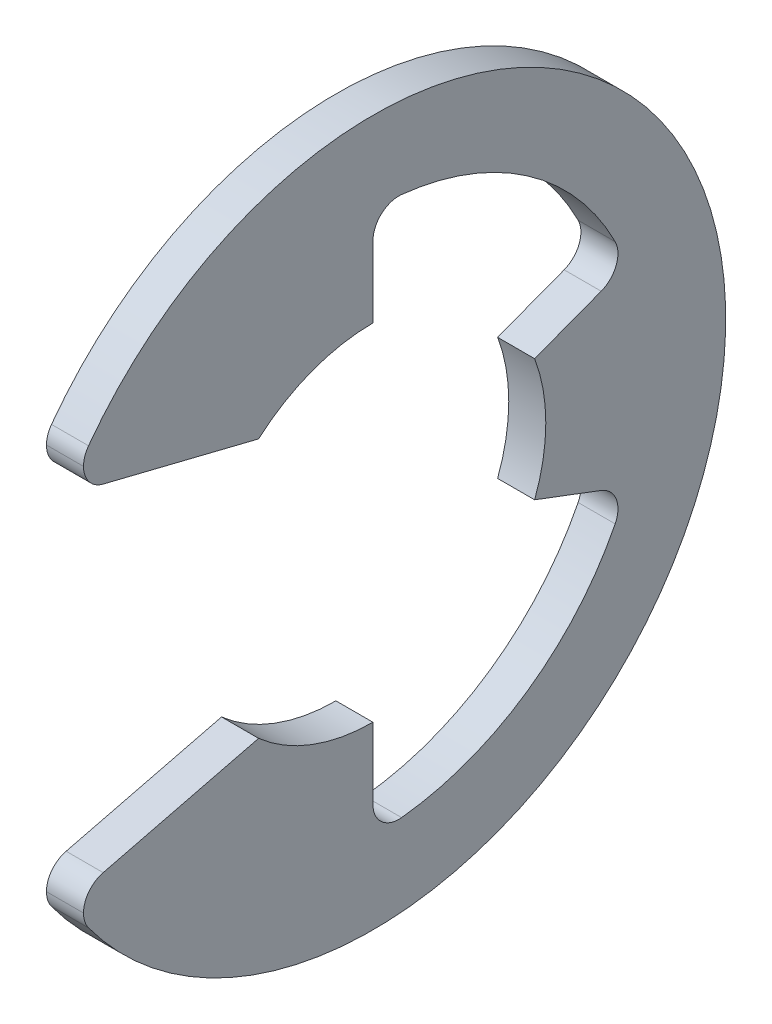
ISO-10303-21;
HEADER;
FILE_DESCRIPTION(('STEP AP214'),'2;1');
FILE_NAME('part.step','',(''),(''),'','','');
FILE_SCHEMA(('AUTOMOTIVE_DESIGN { 1 0 10303 214 1 1 1 1 }'));
ENDSEC;
DATA;
#1=APPLICATION_CONTEXT('core data for automotive mechanical design processes');
#2=APPLICATION_PROTOCOL_DEFINITION('international standard','automotive_design',2000,#1);
#3=PRODUCT_CONTEXT('',#1,'mechanical');
#4=PRODUCT('Part','Part','',(#3));
#5=PRODUCT_RELATED_PRODUCT_CATEGORY('part','',(#4));
#6=PRODUCT_DEFINITION_FORMATION('','',#4);
#7=PRODUCT_DEFINITION_CONTEXT('part definition',#1,'design');
#8=PRODUCT_DEFINITION('design','',#6,#7);
#9=PRODUCT_DEFINITION_SHAPE('','',#8);
#10=(LENGTH_UNIT() NAMED_UNIT(*) SI_UNIT(.MILLI.,.METRE.));
#11=(NAMED_UNIT(*) PLANE_ANGLE_UNIT() SI_UNIT($,.RADIAN.));
#12=(NAMED_UNIT(*) SI_UNIT($,.STERADIAN.) SOLID_ANGLE_UNIT());
#13=UNCERTAINTY_MEASURE_WITH_UNIT(LENGTH_MEASURE(1.E-05),#10,'distance_accuracy_value','');
#14=(GEOMETRIC_REPRESENTATION_CONTEXT(3) GLOBAL_UNCERTAINTY_ASSIGNED_CONTEXT((#13)) GLOBAL_UNIT_ASSIGNED_CONTEXT((#10,
#11,#12)) REPRESENTATION_CONTEXT('',''));
#15=CARTESIAN_POINT('',(0.,0.,0.));
#16=DIRECTION('',(0.,0.,1.));
#17=DIRECTION('',(1.,0.,0.));
#18=AXIS2_PLACEMENT_3D('',#15,#16,#17);
#19=CARTESIAN_POINT('',(0.5334,3.18296391887085,-6.30917472174839));
#20=DIRECTION('',(-1.,0.,0.));
#21=DIRECTION('',(0.,0.,1.));
#22=AXIS2_PLACEMENT_3D('',#19,#20,#21);
#23=CYLINDRICAL_SURFACE('',#22,0.74676);
#24=CARTESIAN_POINT('',(0.5334,3.18296391887085,-6.30917472174839));
#25=DIRECTION('',(-1.,0.,0.));
#26=DIRECTION('',(0.,0.,-1.));
#27=AXIS2_PLACEMENT_3D('',#24,#25,#26);
#28=CIRCLE('',#27,0.74676);
#29=CARTESIAN_POINT('',(0.5334,3.51932193149276,-6.97589339176224));
#30=VERTEX_POINT('',#29);
#31=CARTESIAN_POINT('',(0.5334,2.48443390133403,-6.57319425170782));
#32=VERTEX_POINT('',#31);
#33=EDGE_CURVE('E407',#30,#32,#28,.T.);
#34=ORIENTED_EDGE('',*,*,#33,.F.);
#35=DIRECTION('',(1.,0.,0.));
#36=VECTOR('',#35,1.);
#37=CARTESIAN_POINT('',(0.5334,3.51932193149276,-6.97589339176224));
#38=LINE('',#37,#36);
#39=CARTESIAN_POINT('',(-0.5334,3.51932193149276,-6.97589339176224));
#40=VERTEX_POINT('',#39);
#41=EDGE_CURVE('E288',#40,#30,#38,.T.);
#42=ORIENTED_EDGE('',*,*,#41,.F.);
#43=CARTESIAN_POINT('',(-0.5334,3.18296391887085,-6.30917472174839));
#44=DIRECTION('',(1.,0.,0.));
#45=DIRECTION('',(0.,0.,-1.));
#46=AXIS2_PLACEMENT_3D('',#43,#44,#45);
#47=CIRCLE('',#46,0.74676);
#48=CARTESIAN_POINT('',(-0.5334,2.48443390133403,-6.57319425170782));
#49=VERTEX_POINT('',#48);
#50=EDGE_CURVE('E424',#49,#40,#47,.T.);
#51=ORIENTED_EDGE('',*,*,#50,.F.);
#52=DIRECTION('',(-1.,0.,0.));
#53=VECTOR('',#52,1.);
#54=CARTESIAN_POINT('',(-0.5334,2.48443390133403,-6.57319425170782));
#55=LINE('',#54,#53);
#56=EDGE_CURVE('E238',#32,#49,#55,.T.);
#57=ORIENTED_EDGE('',*,*,#56,.F.);
#58=EDGE_LOOP('',(#34,#42,#51,#57));
#59=FACE_BOUND('',#58,.T.);
#60=ADVANCED_FACE('F16',(#59),#23,.F.);
#61=CARTESIAN_POINT('',(0.5334,-3.18296391887085,-6.30917472174839));
#62=DIRECTION('',(-1.,0.,0.));
#63=DIRECTION('',(0.,0.,1.));
#64=AXIS2_PLACEMENT_3D('',#61,#62,#63);
#65=CYLINDRICAL_SURFACE('',#64,0.74676);
#66=CARTESIAN_POINT('',(0.5334,-3.18296391887085,-6.30917472174839));
#67=DIRECTION('',(-1.,0.,0.));
#68=DIRECTION('',(0.,0.,-1.));
#69=AXIS2_PLACEMENT_3D('',#66,#67,#68);
#70=CIRCLE('',#69,0.74676);
#71=CARTESIAN_POINT('',(0.5334,-2.48443390133402,-6.57319425170782));
#72=VERTEX_POINT('',#71);
#73=CARTESIAN_POINT('',(0.5334,-3.51932193149276,-6.97589339176224));
#74=VERTEX_POINT('',#73);
#75=EDGE_CURVE('E410',#72,#74,#70,.T.);
#76=ORIENTED_EDGE('',*,*,#75,.F.);
#77=DIRECTION('',(1.,0.,0.));
#78=VECTOR('',#77,1.);
#79=CARTESIAN_POINT('',(0.5334,-2.48443390133402,-6.57319425170782));
#80=LINE('',#79,#78);
#81=CARTESIAN_POINT('',(-0.5334,-2.48443390133402,-6.57319425170782));
#82=VERTEX_POINT('',#81);
#83=EDGE_CURVE('E350',#82,#72,#80,.T.);
#84=ORIENTED_EDGE('',*,*,#83,.F.);
#85=CARTESIAN_POINT('',(-0.5334,-3.18296391887085,-6.30917472174839));
#86=DIRECTION('',(1.,0.,0.));
#87=DIRECTION('',(0.,0.,-1.));
#88=AXIS2_PLACEMENT_3D('',#85,#86,#87);
#89=CIRCLE('',#88,0.74676);
#90=CARTESIAN_POINT('',(-0.5334,-3.51932193149276,-6.97589339176224));
#91=VERTEX_POINT('',#90);
#92=EDGE_CURVE('E421',#91,#82,#89,.T.);
#93=ORIENTED_EDGE('',*,*,#92,.F.);
#94=DIRECTION('',(-1.,0.,0.));
#95=VECTOR('',#94,1.);
#96=CARTESIAN_POINT('',(0.5334,-3.51932193149276,-6.97589339176224));
#97=LINE('',#96,#95);
#98=EDGE_CURVE('E370',#74,#91,#97,.T.);
#99=ORIENTED_EDGE('',*,*,#98,.F.);
#100=EDGE_LOOP('',(#76,#84,#93,#99));
#101=FACE_BOUND('',#100,.T.);
#102=ADVANCED_FACE('F18',(#101),#65,.F.);
#103=CARTESIAN_POINT('',(0.5334,5.56971982551659,7.58863020332704));
#104=DIRECTION('',(-1.,0.,0.));
#105=DIRECTION('',(0.,0.,1.));
#106=AXIS2_PLACEMENT_3D('',#103,#104,#105);
#107=CYLINDRICAL_SURFACE('',#106,0.74676);
#108=DIRECTION('',(-1.,0.,0.));
#109=VECTOR('',#108,1.);
#110=CARTESIAN_POINT('',(0.5334,5.56971982551659,8.33539020332704));
#111=LINE('',#110,#109);
#112=CARTESIAN_POINT('',(0.5334,5.56971982551659,8.33539020332704));
#113=VERTEX_POINT('',#112);
#114=CARTESIAN_POINT('',(-0.5334,5.56971982551659,8.33539020332704));
#115=VERTEX_POINT('',#114);
#116=EDGE_CURVE('E217',#113,#115,#111,.T.);
#117=ORIENTED_EDGE('',*,*,#116,.F.);
#118=CARTESIAN_POINT('',(0.5334,5.56971982551659,7.58863020332704));
#119=DIRECTION('',(1.,0.,0.));
#120=DIRECTION('',(0.,0.,-1.));
#121=AXIS2_PLACEMENT_3D('',#118,#119,#120);
#122=CIRCLE('',#121,0.74676);
#123=CARTESIAN_POINT('',(0.5334,6.01157023801035,8.19064242129201));
#124=VERTEX_POINT('',#123);
#125=EDGE_CURVE('E202',#124,#113,#122,.T.);
#126=ORIENTED_EDGE('',*,*,#125,.F.);
#127=DIRECTION('',(1.,0.,0.));
#128=VECTOR('',#127,1.);
#129=CARTESIAN_POINT('',(0.5334,6.01157023801035,8.19064242129201));
#130=LINE('',#129,#128);
#131=CARTESIAN_POINT('',(-0.5334,6.01157023801035,8.19064242129201));
#132=VERTEX_POINT('',#131);
#133=EDGE_CURVE('E280',#132,#124,#130,.T.);
#134=ORIENTED_EDGE('',*,*,#133,.F.);
#135=CARTESIAN_POINT('',(-0.5334,5.56971982551659,7.58863020332704));
#136=DIRECTION('',(-1.,0.,0.));
#137=DIRECTION('',(0.,0.,-1.));
#138=AXIS2_PLACEMENT_3D('',#135,#136,#137);
#139=CIRCLE('',#138,0.74676);
#140=EDGE_CURVE('E11',#115,#132,#139,.T.);
#141=ORIENTED_EDGE('',*,*,#140,.F.);
#142=EDGE_LOOP('',(#117,#126,#134,#141));
#143=FACE_BOUND('',#142,.T.);
#144=ADVANCED_FACE('F218',(#143),#107,.T.);
#145=CARTESIAN_POINT('',(0.5334,-5.56971982551659,7.58863020332704));
#146=DIRECTION('',(-1.,0.,0.));
#147=DIRECTION('',(0.,0.,1.));
#148=AXIS2_PLACEMENT_3D('',#145,#146,#147);
#149=CYLINDRICAL_SURFACE('',#148,0.74676);
#150=DIRECTION('',(-1.,0.,0.));
#151=VECTOR('',#150,1.);
#152=CARTESIAN_POINT('',(0.5334,-5.56971982551659,8.33539020332704));
#153=LINE('',#152,#151);
#154=CARTESIAN_POINT('',(0.5334,-5.56971982551659,8.33539020332704));
#155=VERTEX_POINT('',#154);
#156=CARTESIAN_POINT('',(-0.5334,-5.56971982551659,8.33539020332704));
#157=VERTEX_POINT('',#156);
#158=EDGE_CURVE('E269',#155,#157,#153,.T.);
#159=ORIENTED_EDGE('',*,*,#158,.F.);
#160=CARTESIAN_POINT('',(0.5334,-5.56971982551659,7.58863020332704));
#161=DIRECTION('',(1.,0.,0.));
#162=DIRECTION('',(0.,0.,-1.));
#163=AXIS2_PLACEMENT_3D('',#160,#161,#162);
#164=CIRCLE('',#163,0.74676);
#165=CARTESIAN_POINT('',(0.5334,-4.84496174240152,7.76856413164343));
#166=VERTEX_POINT('',#165);
#167=EDGE_CURVE('E38',#166,#155,#164,.T.);
#168=ORIENTED_EDGE('',*,*,#167,.F.);
#169=DIRECTION('',(1.,0.,0.));
#170=VECTOR('',#169,1.);
#171=CARTESIAN_POINT('',(0.5334,-4.84496174240152,7.76856413164343));
#172=LINE('',#171,#170);
#173=CARTESIAN_POINT('',(-0.5334,-4.84496174240152,7.76856413164343));
#174=VERTEX_POINT('',#173);
#175=EDGE_CURVE('E389',#174,#166,#172,.T.);
#176=ORIENTED_EDGE('',*,*,#175,.F.);
#177=CARTESIAN_POINT('',(-0.5334,-5.56971982551659,7.58863020332704));
#178=DIRECTION('',(-1.,0.,0.));
#179=DIRECTION('',(0.,0.,-1.));
#180=AXIS2_PLACEMENT_3D('',#177,#178,#179);
#181=CIRCLE('',#180,0.74676);
#182=EDGE_CURVE('E49',#157,#174,#181,.T.);
#183=ORIENTED_EDGE('',*,*,#182,.F.);
#184=EDGE_LOOP('',(#159,#168,#176,#183));
#185=FACE_BOUND('',#184,.T.);
#186=ADVANCED_FACE('F495',(#185),#149,.T.);
#187=CARTESIAN_POINT('',(0.5334,7.02704023617216,-0.74676));
#188=DIRECTION('',(-1.,0.,0.));
#189=DIRECTION('',(0.,0.,1.));
#190=AXIS2_PLACEMENT_3D('',#187,#188,#189);
#191=CYLINDRICAL_SURFACE('',#190,0.74676);
#192=CARTESIAN_POINT('',(0.5334,7.02704023617216,-0.74676));
#193=DIRECTION('',(-1.,0.,0.));
#194=DIRECTION('',(0.,0.,-1.));
#195=AXIS2_PLACEMENT_3D('',#192,#193,#194);
#196=CIRCLE('',#195,0.74676);
#197=CARTESIAN_POINT('',(0.5334,7.02704023617216,0.));
#198=VERTEX_POINT('',#197);
#199=CARTESIAN_POINT('',(0.5334,7.76961896112721,-0.825673464276603));
#200=VERTEX_POINT('',#199);
#201=EDGE_CURVE('E214',#198,#200,#196,.T.);
#202=ORIENTED_EDGE('',*,*,#201,.F.);
#203=DIRECTION('',(1.,0.,0.));
#204=VECTOR('',#203,1.);
#205=CARTESIAN_POINT('',(0.5334,7.02704023617216,0.));
#206=LINE('',#205,#204);
#207=CARTESIAN_POINT('',(-0.5334,7.02704023617216,0.));
#208=VERTEX_POINT('',#207);
#209=EDGE_CURVE('E318',#208,#198,#206,.T.);
#210=ORIENTED_EDGE('',*,*,#209,.F.);
#211=CARTESIAN_POINT('',(-0.5334,7.02704023617216,-0.74676));
#212=DIRECTION('',(1.,0.,0.));
#213=DIRECTION('',(0.,0.,-1.));
#214=AXIS2_PLACEMENT_3D('',#211,#212,#213);
#215=CIRCLE('',#214,0.74676);
#216=CARTESIAN_POINT('',(-0.5334,7.76961896112721,-0.825673464276603));
#217=VERTEX_POINT('',#216);
#218=EDGE_CURVE('E25',#217,#208,#215,.T.);
#219=ORIENTED_EDGE('',*,*,#218,.F.);
#220=DIRECTION('',(-1.,0.,0.));
#221=VECTOR('',#220,1.);
#222=CARTESIAN_POINT('',(0.5334,7.76961896112721,-0.825673464276603));
#223=LINE('',#222,#221);
#224=EDGE_CURVE('E250',#200,#217,#223,.T.);
#225=ORIENTED_EDGE('',*,*,#224,.F.);
#226=EDGE_LOOP('',(#202,#210,#219,#225));
#227=FACE_BOUND('',#226,.T.);
#228=ADVANCED_FACE('F441',(#227),#191,.F.);
#229=CARTESIAN_POINT('',(0.5334,-7.02704023617216,-0.74676));
#230=DIRECTION('',(-1.,0.,0.));
#231=DIRECTION('',(0.,0.,1.));
#232=AXIS2_PLACEMENT_3D('',#229,#230,#231);
#233=CYLINDRICAL_SURFACE('',#232,0.74676);
#234=CARTESIAN_POINT('',(0.5334,-7.02704023617216,-0.74676));
#235=DIRECTION('',(-1.,0.,0.));
#236=DIRECTION('',(0.,0.,-1.));
#237=AXIS2_PLACEMENT_3D('',#234,#235,#236);
#238=CIRCLE('',#237,0.74676);
#239=CARTESIAN_POINT('',(0.5334,-7.76961896112721,-0.825673464276605));
#240=VERTEX_POINT('',#239);
#241=CARTESIAN_POINT('',(0.5334,-7.02704023617216,0.));
#242=VERTEX_POINT('',#241);
#243=EDGE_CURVE('E413',#240,#242,#238,.T.);
#244=ORIENTED_EDGE('',*,*,#243,.F.);
#245=DIRECTION('',(1.,0.,0.));
#246=VECTOR('',#245,1.);
#247=CARTESIAN_POINT('',(0.5334,-7.76961896112721,-0.825673464276605));
#248=LINE('',#247,#246);
#249=CARTESIAN_POINT('',(-0.5334,-7.76961896112721,-0.825673464276605));
#250=VERTEX_POINT('',#249);
#251=EDGE_CURVE('E362',#250,#240,#248,.T.);
#252=ORIENTED_EDGE('',*,*,#251,.F.);
#253=CARTESIAN_POINT('',(-0.5334,-7.02704023617216,-0.74676));
#254=DIRECTION('',(1.,0.,0.));
#255=DIRECTION('',(0.,0.,-1.));
#256=AXIS2_PLACEMENT_3D('',#253,#254,#255);
#257=CIRCLE('',#256,0.74676);
#258=CARTESIAN_POINT('',(-0.5334,-7.02704023617216,0.));
#259=VERTEX_POINT('',#258);
#260=EDGE_CURVE('E418',#259,#250,#257,.T.);
#261=ORIENTED_EDGE('',*,*,#260,.F.);
#262=DIRECTION('',(-1.,0.,0.));
#263=VECTOR('',#262,1.);
#264=CARTESIAN_POINT('',(-0.5334,-7.02704023617216,0.));
#265=LINE('',#264,#263);
#266=EDGE_CURVE('E293',#242,#259,#265,.T.);
#267=ORIENTED_EDGE('',*,*,#266,.F.);
#268=EDGE_LOOP('',(#244,#252,#261,#267));
#269=FACE_BOUND('',#268,.T.);
#270=ADVANCED_FACE('F485',(#269),#233,.F.);
#271=CARTESIAN_POINT('',(-0.5334,0.,0.));
#272=DIRECTION('',(1.,0.,0.));
#273=DIRECTION('',(0.,1.,0.));
#274=AXIS2_PLACEMENT_3D('',#271,#272,#273);
#275=PLANE('',#274);
#276=CARTESIAN_POINT('',(-0.5334,0.,0.));
#277=DIRECTION('',(1.,0.,0.));
#278=DIRECTION('',(0.,0.,-1.));
#279=AXIS2_PLACEMENT_3D('',#276,#277,#278);
#280=CIRCLE('',#279,10.16);
#281=CARTESIAN_POINT('',(-0.5334,-6.01157023801035,8.19064242129201));
#282=VERTEX_POINT('',#281);
#283=EDGE_CURVE('E257',#282,#132,#280,.T.);
#284=ORIENTED_EDGE('',*,*,#283,.F.);
#285=CARTESIAN_POINT('',(-0.5334,-5.56971982551659,7.58863020332704));
#286=DIRECTION('',(-1.,0.,0.));
#287=DIRECTION('',(0.,0.,-1.));
#288=AXIS2_PLACEMENT_3D('',#285,#286,#287);
#289=CIRCLE('',#288,0.74676);
#290=EDGE_CURVE('E273',#282,#157,#289,.T.);
#291=ORIENTED_EDGE('',*,*,#290,.T.);
#292=ORIENTED_EDGE('',*,*,#182,.T.);
#293=DIRECTION('',(0.,-0.240952820606873,0.970536829925373));
#294=VECTOR('',#293,1.);
#295=CARTESIAN_POINT('',(-0.5334,-5.09813480407811,8.78832302088672));
#296=LINE('',#295,#294);
#297=CARTESIAN_POINT('',(-0.5334,-3.7338,3.29290208175099));
#298=VERTEX_POINT('',#297);
#299=EDGE_CURVE('E394',#298,#174,#296,.T.);
#300=ORIENTED_EDGE('',*,*,#299,.F.);
#301=CARTESIAN_POINT('',(-0.5334,0.,0.));
#302=DIRECTION('',(-1.,0.,0.));
#303=DIRECTION('',(0.,0.,-1.));
#304=AXIS2_PLACEMENT_3D('',#301,#302,#303);
#305=CIRCLE('',#304,4.9784);
#306=CARTESIAN_POINT('',(-0.5334,-4.9784,0.));
#307=VERTEX_POINT('',#306);
#308=EDGE_CURVE('E380',#307,#298,#305,.T.);
#309=ORIENTED_EDGE('',*,*,#308,.F.);
#310=DIRECTION('',(0.,1.,0.));
#311=VECTOR('',#310,1.);
#312=CARTESIAN_POINT('',(-0.5334,-4.9784,0.));
#313=LINE('',#312,#311);
#314=EDGE_CURVE('E297',#259,#307,#313,.T.);
#315=ORIENTED_EDGE('',*,*,#314,.F.);
#316=ORIENTED_EDGE('',*,*,#260,.T.);
#317=CARTESIAN_POINT('',(-0.5334,0.,0.));
#318=DIRECTION('',(-1.,0.,0.));
#319=DIRECTION('',(0.,0.,-1.));
#320=AXIS2_PLACEMENT_3D('',#317,#318,#319);
#321=CIRCLE('',#320,7.81336774193548);
#322=EDGE_CURVE('E358',#91,#250,#321,.T.);
#323=ORIENTED_EDGE('',*,*,#322,.F.);
#324=ORIENTED_EDGE('',*,*,#92,.T.);
#325=DIRECTION('',(0.,-0.353553390593274,-0.935414346693485));
#326=VECTOR('',#325,1.);
#327=CARTESIAN_POINT('',(-0.5334,-1.76013019972956,-4.65686678357885));
#328=LINE('',#327,#326);
#329=CARTESIAN_POINT('',(-0.5334,-1.76013019972956,-4.65686678357885));
#330=VERTEX_POINT('',#329);
#331=EDGE_CURVE('E342',#330,#82,#328,.T.);
#332=ORIENTED_EDGE('',*,*,#331,.F.);
#333=CARTESIAN_POINT('',(-0.5334,0.,0.));
#334=DIRECTION('',(-1.,0.,0.));
#335=DIRECTION('',(0.,0.,1.));
#336=AXIS2_PLACEMENT_3D('',#333,#334,#335);
#337=CIRCLE('',#336,4.9784);
#338=CARTESIAN_POINT('',(-0.5334,1.76013019972956,-4.65686678357885));
#339=VERTEX_POINT('',#338);
#340=EDGE_CURVE('E266',#339,#330,#337,.T.);
#341=ORIENTED_EDGE('',*,*,#340,.F.);
#342=DIRECTION('',(0.,-0.353553390593274,0.935414346693485));
#343=VECTOR('',#342,1.);
#344=CARTESIAN_POINT('',(-0.5334,1.76013019972956,-4.65686678357885));
#345=LINE('',#344,#343);
#346=EDGE_CURVE('E242',#49,#339,#345,.T.);
#347=ORIENTED_EDGE('',*,*,#346,.F.);
#348=ORIENTED_EDGE('',*,*,#50,.T.);
#349=CARTESIAN_POINT('',(-0.5334,0.,0.));
#350=DIRECTION('',(-1.,0.,0.));
#351=DIRECTION('',(0.,0.,-1.));
#352=AXIS2_PLACEMENT_3D('',#349,#350,#351);
#353=CIRCLE('',#352,7.81336774193549);
#354=EDGE_CURVE('E254',#217,#40,#353,.T.);
#355=ORIENTED_EDGE('',*,*,#354,.F.);
#356=ORIENTED_EDGE('',*,*,#218,.T.);
#357=DIRECTION('',(0.,1.,0.));
#358=VECTOR('',#357,1.);
#359=CARTESIAN_POINT('',(-0.5334,4.9784,0.));
#360=LINE('',#359,#358);
#361=CARTESIAN_POINT('',(-0.5334,4.9784,0.));
#362=VERTEX_POINT('',#361);
#363=EDGE_CURVE('E314',#362,#208,#360,.T.);
#364=ORIENTED_EDGE('',*,*,#363,.F.);
#365=CARTESIAN_POINT('',(-0.5334,0.,0.));
#366=DIRECTION('',(-1.,0.,0.));
#367=DIRECTION('',(0.,0.,1.));
#368=AXIS2_PLACEMENT_3D('',#365,#366,#367);
#369=CIRCLE('',#368,4.9784);
#370=CARTESIAN_POINT('',(-0.5334,3.7338,3.29290208175099));
#371=VERTEX_POINT('',#370);
#372=EDGE_CURVE('E248',#371,#362,#369,.T.);
#373=ORIENTED_EDGE('',*,*,#372,.F.);
#374=DIRECTION('',(0.,-0.240952820606873,-0.970536829925373));
#375=VECTOR('',#374,1.);
#376=CARTESIAN_POINT('',(-0.5334,5.09813480407811,8.78832302088672));
#377=LINE('',#376,#375);
#378=CARTESIAN_POINT('',(-0.5334,4.84496174240152,7.76856413164343));
#379=VERTEX_POINT('',#378);
#380=EDGE_CURVE('E249',#379,#371,#377,.T.);
#381=ORIENTED_EDGE('',*,*,#380,.F.);
#382=CARTESIAN_POINT('',(-0.5334,5.56971982551659,7.58863020332704));
#383=DIRECTION('',(-1.,0.,0.));
#384=DIRECTION('',(0.,0.,-1.));
#385=AXIS2_PLACEMENT_3D('',#382,#383,#384);
#386=CIRCLE('',#385,0.74676);
#387=EDGE_CURVE('E223',#379,#115,#386,.T.);
#388=ORIENTED_EDGE('',*,*,#387,.T.);
#389=ORIENTED_EDGE('',*,*,#140,.T.);
#390=EDGE_LOOP('',(#284,#291,#292,#300,#309,#315,#316,#323,#324,#332,#341,#347,#348,#355,#356,
#364,#373,#381,#388,#389));
#391=FACE_BOUND('',#390,.T.);
#392=ADVANCED_FACE('F432',(#391),#275,.F.);
#393=CARTESIAN_POINT('',(0.5334,0.,0.));
#394=DIRECTION('',(1.,0.,0.));
#395=DIRECTION('',(0.,1.,0.));
#396=AXIS2_PLACEMENT_3D('',#393,#394,#395);
#397=PLANE('',#396);
#398=DIRECTION('',(0.,-0.240952820606873,0.970536829925373));
#399=VECTOR('',#398,1.);
#400=CARTESIAN_POINT('',(0.5334,-5.09813480407811,8.78832302088672));
#401=LINE('',#400,#399);
#402=CARTESIAN_POINT('',(0.5334,-3.7338,3.29290208175099));
#403=VERTEX_POINT('',#402);
#404=EDGE_CURVE('E393',#403,#166,#401,.T.);
#405=ORIENTED_EDGE('',*,*,#404,.T.);
#406=ORIENTED_EDGE('',*,*,#167,.T.);
#407=CARTESIAN_POINT('',(0.5334,-5.56971982551659,7.58863020332704));
#408=DIRECTION('',(1.,0.,0.));
#409=DIRECTION('',(0.,0.,-1.));
#410=AXIS2_PLACEMENT_3D('',#407,#408,#409);
#411=CIRCLE('',#410,0.74676);
#412=CARTESIAN_POINT('',(0.5334,-6.01157023801035,8.19064242129201));
#413=VERTEX_POINT('',#412);
#414=EDGE_CURVE('E236',#155,#413,#411,.T.);
#415=ORIENTED_EDGE('',*,*,#414,.T.);
#416=CARTESIAN_POINT('',(0.5334,0.,0.));
#417=DIRECTION('',(1.,0.,0.));
#418=DIRECTION('',(0.,0.,-1.));
#419=AXIS2_PLACEMENT_3D('',#416,#417,#418);
#420=CIRCLE('',#419,10.16);
#421=EDGE_CURVE('E209',#413,#124,#420,.T.);
#422=ORIENTED_EDGE('',*,*,#421,.T.);
#423=ORIENTED_EDGE('',*,*,#125,.T.);
#424=CARTESIAN_POINT('',(0.5334,5.56971982551659,7.58863020332704));
#425=DIRECTION('',(1.,0.,0.));
#426=DIRECTION('',(0.,0.,-1.));
#427=AXIS2_PLACEMENT_3D('',#424,#425,#426);
#428=CIRCLE('',#427,0.74676);
#429=CARTESIAN_POINT('',(0.5334,4.84496174240152,7.76856413164343));
#430=VERTEX_POINT('',#429);
#431=EDGE_CURVE('E207',#113,#430,#428,.T.);
#432=ORIENTED_EDGE('',*,*,#431,.T.);
#433=DIRECTION('',(0.,-0.240952820606873,-0.970536829925373));
#434=VECTOR('',#433,1.);
#435=CARTESIAN_POINT('',(0.5334,5.09813480407811,8.78832302088672));
#436=LINE('',#435,#434);
#437=CARTESIAN_POINT('',(0.5334,3.7338,3.29290208175099));
#438=VERTEX_POINT('',#437);
#439=EDGE_CURVE('E284',#430,#438,#436,.T.);
#440=ORIENTED_EDGE('',*,*,#439,.T.);
#441=CARTESIAN_POINT('',(0.5334,0.,0.));
#442=DIRECTION('',(-1.,0.,0.));
#443=DIRECTION('',(0.,0.,1.));
#444=AXIS2_PLACEMENT_3D('',#441,#442,#443);
#445=CIRCLE('',#444,4.9784);
#446=CARTESIAN_POINT('',(0.5334,4.9784,0.));
#447=VERTEX_POINT('',#446);
#448=EDGE_CURVE('E310',#438,#447,#445,.T.);
#449=ORIENTED_EDGE('',*,*,#448,.T.);
#450=DIRECTION('',(0.,1.,0.));
#451=VECTOR('',#450,1.);
#452=CARTESIAN_POINT('',(0.5334,4.9784,0.));
#453=LINE('',#452,#451);
#454=EDGE_CURVE('E322',#447,#198,#453,.T.);
#455=ORIENTED_EDGE('',*,*,#454,.T.);
#456=ORIENTED_EDGE('',*,*,#201,.T.);
#457=CARTESIAN_POINT('',(0.5334,0.,0.));
#458=DIRECTION('',(-1.,0.,0.));
#459=DIRECTION('',(0.,0.,-1.));
#460=AXIS2_PLACEMENT_3D('',#457,#458,#459);
#461=CIRCLE('',#460,7.81336774193549);
#462=EDGE_CURVE('E255',#200,#30,#461,.T.);
#463=ORIENTED_EDGE('',*,*,#462,.T.);
#464=ORIENTED_EDGE('',*,*,#33,.T.);
#465=DIRECTION('',(0.,-0.353553390593274,0.935414346693485));
#466=VECTOR('',#465,1.);
#467=CARTESIAN_POINT('',(0.5334,1.76013019972956,-4.65686678357885));
#468=LINE('',#467,#466);
#469=CARTESIAN_POINT('',(0.5334,1.76013019972956,-4.65686678357885));
#470=VERTEX_POINT('',#469);
#471=EDGE_CURVE('E243',#32,#470,#468,.T.);
#472=ORIENTED_EDGE('',*,*,#471,.T.);
#473=CARTESIAN_POINT('',(0.5334,0.,0.));
#474=DIRECTION('',(-1.,0.,0.));
#475=DIRECTION('',(0.,0.,1.));
#476=AXIS2_PLACEMENT_3D('',#473,#474,#475);
#477=CIRCLE('',#476,4.9784);
#478=CARTESIAN_POINT('',(0.5334,-1.76013019972956,-4.65686678357885));
#479=VERTEX_POINT('',#478);
#480=EDGE_CURVE('E338',#470,#479,#477,.T.);
#481=ORIENTED_EDGE('',*,*,#480,.T.);
#482=DIRECTION('',(0.,-0.353553390593274,-0.935414346693485));
#483=VECTOR('',#482,1.);
#484=CARTESIAN_POINT('',(0.5334,-1.76013019972956,-4.65686678357885));
#485=LINE('',#484,#483);
#486=EDGE_CURVE('E354',#479,#72,#485,.T.);
#487=ORIENTED_EDGE('',*,*,#486,.T.);
#488=ORIENTED_EDGE('',*,*,#75,.T.);
#489=CARTESIAN_POINT('',(0.5334,0.,0.));
#490=DIRECTION('',(-1.,0.,0.));
#491=DIRECTION('',(0.,0.,-1.));
#492=AXIS2_PLACEMENT_3D('',#489,#490,#491);
#493=CIRCLE('',#492,7.81336774193548);
#494=EDGE_CURVE('E366',#74,#240,#493,.T.);
#495=ORIENTED_EDGE('',*,*,#494,.T.);
#496=ORIENTED_EDGE('',*,*,#243,.T.);
#497=DIRECTION('',(0.,1.,0.));
#498=VECTOR('',#497,1.);
#499=CARTESIAN_POINT('',(0.5334,-4.9784,0.));
#500=LINE('',#499,#498);
#501=CARTESIAN_POINT('',(0.5334,-4.9784,0.));
#502=VERTEX_POINT('',#501);
#503=EDGE_CURVE('E298',#242,#502,#500,.T.);
#504=ORIENTED_EDGE('',*,*,#503,.T.);
#505=CARTESIAN_POINT('',(0.5334,0.,0.));
#506=DIRECTION('',(-1.,0.,0.));
#507=DIRECTION('',(0.,0.,-1.));
#508=AXIS2_PLACEMENT_3D('',#505,#506,#507);
#509=CIRCLE('',#508,4.9784);
#510=EDGE_CURVE('E388',#502,#403,#509,.T.);
#511=ORIENTED_EDGE('',*,*,#510,.T.);
#512=EDGE_LOOP('',(#405,#406,#415,#422,#423,#432,#440,#449,#455,#456,#463,#464,#472,#481,#487,
#488,#495,#496,#504,#511));
#513=FACE_BOUND('',#512,.T.);
#514=ADVANCED_FACE('F204',(#513),#397,.T.);
#515=CARTESIAN_POINT('',(0.5334,-5.09813480407811,8.78832302088672));
#516=DIRECTION('',(0.,-0.970536829925373,-0.240952820606873));
#517=DIRECTION('',(0.,0.240952820606873,-0.970536829925373));
#518=AXIS2_PLACEMENT_3D('',#515,#516,#517);
#519=PLANE('',#518);
#520=ORIENTED_EDGE('',*,*,#299,.T.);
#521=ORIENTED_EDGE('',*,*,#175,.T.);
#522=ORIENTED_EDGE('',*,*,#404,.F.);
#523=DIRECTION('',(-1.,0.,0.));
#524=VECTOR('',#523,1.);
#525=CARTESIAN_POINT('',(0.5334,-3.7338,3.29290208175099));
#526=LINE('',#525,#524);
#527=EDGE_CURVE('E384',#403,#298,#526,.T.);
#528=ORIENTED_EDGE('',*,*,#527,.T.);
#529=EDGE_LOOP('',(#520,#521,#522,#528));
#530=FACE_BOUND('',#529,.T.);
#531=ADVANCED_FACE('F494',(#530),#519,.F.);
#532=CARTESIAN_POINT('',(0.5334,0.,0.));
#533=DIRECTION('',(-1.,0.,0.));
#534=DIRECTION('',(0.,0.,1.));
#535=AXIS2_PLACEMENT_3D('',#532,#533,#534);
#536=CYLINDRICAL_SURFACE('',#535,4.9784);
#537=ORIENTED_EDGE('',*,*,#308,.T.);
#538=ORIENTED_EDGE('',*,*,#527,.F.);
#539=ORIENTED_EDGE('',*,*,#510,.F.);
#540=DIRECTION('',(-1.,0.,0.));
#541=VECTOR('',#540,1.);
#542=CARTESIAN_POINT('',(0.5334,-4.9784,0.));
#543=LINE('',#542,#541);
#544=EDGE_CURVE('E346',#502,#307,#543,.T.);
#545=ORIENTED_EDGE('',*,*,#544,.T.);
#546=EDGE_LOOP('',(#537,#538,#539,#545));
#547=FACE_BOUND('',#546,.T.);
#548=ADVANCED_FACE('F491',(#547),#536,.F.);
#549=CARTESIAN_POINT('',(0.5334,-4.9784,0.));
#550=DIRECTION('',(0.,0.,1.));
#551=DIRECTION('',(0.,-1.,0.));
#552=AXIS2_PLACEMENT_3D('',#549,#550,#551);
#553=PLANE('',#552);
#554=ORIENTED_EDGE('',*,*,#503,.F.);
#555=ORIENTED_EDGE('',*,*,#266,.T.);
#556=ORIENTED_EDGE('',*,*,#314,.T.);
#557=ORIENTED_EDGE('',*,*,#544,.F.);
#558=EDGE_LOOP('',(#554,#555,#556,#557));
#559=FACE_BOUND('',#558,.T.);
#560=ADVANCED_FACE('F489',(#559),#553,.F.);
#561=CARTESIAN_POINT('',(0.5334,0.,0.));
#562=DIRECTION('',(-1.,0.,0.));
#563=DIRECTION('',(0.,0.,1.));
#564=AXIS2_PLACEMENT_3D('',#561,#562,#563);
#565=CYLINDRICAL_SURFACE('',#564,7.81336774193548);
#566=ORIENTED_EDGE('',*,*,#322,.T.);
#567=ORIENTED_EDGE('',*,*,#251,.T.);
#568=ORIENTED_EDGE('',*,*,#494,.F.);
#569=ORIENTED_EDGE('',*,*,#98,.T.);
#570=EDGE_LOOP('',(#566,#567,#568,#569));
#571=FACE_BOUND('',#570,.T.);
#572=ADVANCED_FACE('F480',(#571),#565,.F.);
#573=CARTESIAN_POINT('',(0.5334,-1.76013019972956,-4.65686678357885));
#574=DIRECTION('',(0.,0.935414346693485,-0.353553390593274));
#575=DIRECTION('',(-1.,0.,0.));
#576=AXIS2_PLACEMENT_3D('',#573,#574,#575);
#577=PLANE('',#576);
#578=ORIENTED_EDGE('',*,*,#331,.T.);
#579=ORIENTED_EDGE('',*,*,#83,.T.);
#580=ORIENTED_EDGE('',*,*,#486,.F.);
#581=DIRECTION('',(-1.,0.,0.));
#582=VECTOR('',#581,1.);
#583=CARTESIAN_POINT('',(0.5334,-1.76013019972956,-4.65686678357885));
#584=LINE('',#583,#582);
#585=EDGE_CURVE('E302',#479,#330,#584,.T.);
#586=ORIENTED_EDGE('',*,*,#585,.T.);
#587=EDGE_LOOP('',(#578,#579,#580,#586));
#588=FACE_BOUND('',#587,.T.);
#589=ADVANCED_FACE('F475',(#588),#577,.F.);
#590=CARTESIAN_POINT('',(0.5334,0.,0.));
#591=DIRECTION('',(-1.,0.,0.));
#592=DIRECTION('',(0.,0.,1.));
#593=AXIS2_PLACEMENT_3D('',#590,#591,#592);
#594=CYLINDRICAL_SURFACE('',#593,4.9784);
#595=ORIENTED_EDGE('',*,*,#340,.T.);
#596=ORIENTED_EDGE('',*,*,#585,.F.);
#597=ORIENTED_EDGE('',*,*,#480,.F.);
#598=DIRECTION('',(-1.,0.,0.));
#599=VECTOR('',#598,1.);
#600=CARTESIAN_POINT('',(0.5334,1.76013019972956,-4.65686678357885));
#601=LINE('',#600,#599);
#602=EDGE_CURVE('E262',#470,#339,#601,.T.);
#603=ORIENTED_EDGE('',*,*,#602,.T.);
#604=EDGE_LOOP('',(#595,#596,#597,#603));
#605=FACE_BOUND('',#604,.T.);
#606=ADVANCED_FACE('F470',(#605),#594,.F.);
#607=CARTESIAN_POINT('',(0.5334,1.76013019972956,-4.65686678357885));
#608=DIRECTION('',(0.,-0.935414346693485,-0.353553390593274));
#609=DIRECTION('',(0.,0.353553390593274,-0.935414346693485));
#610=AXIS2_PLACEMENT_3D('',#607,#608,#609);
#611=PLANE('',#610);
#612=ORIENTED_EDGE('',*,*,#471,.F.);
#613=ORIENTED_EDGE('',*,*,#56,.T.);
#614=ORIENTED_EDGE('',*,*,#346,.T.);
#615=ORIENTED_EDGE('',*,*,#602,.F.);
#616=EDGE_LOOP('',(#612,#613,#614,#615));
#617=FACE_BOUND('',#616,.T.);
#618=ADVANCED_FACE('F468',(#617),#611,.F.);
#619=CARTESIAN_POINT('',(0.5334,0.,0.));
#620=DIRECTION('',(-1.,0.,0.));
#621=DIRECTION('',(0.,0.,1.));
#622=AXIS2_PLACEMENT_3D('',#619,#620,#621);
#623=CYLINDRICAL_SURFACE('',#622,7.81336774193549);
#624=ORIENTED_EDGE('',*,*,#462,.F.);
#625=ORIENTED_EDGE('',*,*,#224,.T.);
#626=ORIENTED_EDGE('',*,*,#354,.T.);
#627=ORIENTED_EDGE('',*,*,#41,.T.);
#628=EDGE_LOOP('',(#624,#625,#626,#627));
#629=FACE_BOUND('',#628,.T.);
#630=ADVANCED_FACE('F438',(#629),#623,.F.);
#631=CARTESIAN_POINT('',(0.5334,4.9784,0.));
#632=DIRECTION('',(0.,0.,1.));
#633=DIRECTION('',(0.,-1.,0.));
#634=AXIS2_PLACEMENT_3D('',#631,#632,#633);
#635=PLANE('',#634);
#636=ORIENTED_EDGE('',*,*,#363,.T.);
#637=ORIENTED_EDGE('',*,*,#209,.T.);
#638=ORIENTED_EDGE('',*,*,#454,.F.);
#639=DIRECTION('',(-1.,0.,0.));
#640=VECTOR('',#639,1.);
#641=CARTESIAN_POINT('',(0.5334,4.9784,0.));
#642=LINE('',#641,#640);
#643=EDGE_CURVE('E306',#447,#362,#642,.T.);
#644=ORIENTED_EDGE('',*,*,#643,.T.);
#645=EDGE_LOOP('',(#636,#637,#638,#644));
#646=FACE_BOUND('',#645,.T.);
#647=ADVANCED_FACE('F445',(#646),#635,.F.);
#648=CARTESIAN_POINT('',(0.5334,0.,0.));
#649=DIRECTION('',(-1.,0.,0.));
#650=DIRECTION('',(0.,0.,1.));
#651=AXIS2_PLACEMENT_3D('',#648,#649,#650);
#652=CYLINDRICAL_SURFACE('',#651,4.9784);
#653=ORIENTED_EDGE('',*,*,#372,.T.);
#654=ORIENTED_EDGE('',*,*,#643,.F.);
#655=ORIENTED_EDGE('',*,*,#448,.F.);
#656=DIRECTION('',(-1.,0.,0.));
#657=VECTOR('',#656,1.);
#658=CARTESIAN_POINT('',(0.5334,3.7338,3.29290208175099));
#659=LINE('',#658,#657);
#660=EDGE_CURVE('E244',#438,#371,#659,.T.);
#661=ORIENTED_EDGE('',*,*,#660,.T.);
#662=EDGE_LOOP('',(#653,#654,#655,#661));
#663=FACE_BOUND('',#662,.T.);
#664=ADVANCED_FACE('F447',(#663),#652,.F.);
#665=CARTESIAN_POINT('',(0.5334,5.09813480407811,8.78832302088672));
#666=DIRECTION('',(0.,0.970536829925373,-0.240952820606873));
#667=DIRECTION('',(-1.,0.,0.));
#668=AXIS2_PLACEMENT_3D('',#665,#666,#667);
#669=PLANE('',#668);
#670=ORIENTED_EDGE('',*,*,#439,.F.);
#671=DIRECTION('',(-1.,0.,0.));
#672=VECTOR('',#671,1.);
#673=CARTESIAN_POINT('',(0.5334,4.84496174240152,7.76856413164343));
#674=LINE('',#673,#672);
#675=EDGE_CURVE('E228',#430,#379,#674,.T.);
#676=ORIENTED_EDGE('',*,*,#675,.T.);
#677=ORIENTED_EDGE('',*,*,#380,.T.);
#678=ORIENTED_EDGE('',*,*,#660,.F.);
#679=EDGE_LOOP('',(#670,#676,#677,#678));
#680=FACE_BOUND('',#679,.T.);
#681=ADVANCED_FACE('F450',(#680),#669,.F.);
#682=CARTESIAN_POINT('',(0.5334,0.,0.));
#683=DIRECTION('',(-1.,0.,0.));
#684=DIRECTION('',(0.,0.,1.));
#685=AXIS2_PLACEMENT_3D('',#682,#683,#684);
#686=CYLINDRICAL_SURFACE('',#685,10.16);
#687=ORIENTED_EDGE('',*,*,#421,.F.);
#688=DIRECTION('',(-1.,0.,0.));
#689=VECTOR('',#688,1.);
#690=CARTESIAN_POINT('',(0.5334,-6.01157023801035,8.190642421292));
#691=LINE('',#690,#689);
#692=EDGE_CURVE('E258',#413,#282,#691,.T.);
#693=ORIENTED_EDGE('',*,*,#692,.T.);
#694=ORIENTED_EDGE('',*,*,#283,.T.);
#695=ORIENTED_EDGE('',*,*,#133,.T.);
#696=EDGE_LOOP('',(#687,#693,#694,#695));
#697=FACE_BOUND('',#696,.T.);
#698=ADVANCED_FACE('F452',(#697),#686,.T.);
#699=CARTESIAN_POINT('',(0.5334,-5.56971982551659,7.58863020332704));
#700=DIRECTION('',(-1.,0.,0.));
#701=DIRECTION('',(0.,0.,1.));
#702=AXIS2_PLACEMENT_3D('',#699,#700,#701);
#703=CYLINDRICAL_SURFACE('',#702,0.74676);
#704=ORIENTED_EDGE('',*,*,#414,.F.);
#705=ORIENTED_EDGE('',*,*,#158,.T.);
#706=ORIENTED_EDGE('',*,*,#290,.F.);
#707=ORIENTED_EDGE('',*,*,#692,.F.);
#708=EDGE_LOOP('',(#704,#705,#706,#707));
#709=FACE_BOUND('',#708,.T.);
#710=ADVANCED_FACE('F457',(#709),#703,.T.);
#711=CARTESIAN_POINT('',(0.5334,5.56971982551659,7.58863020332704));
#712=DIRECTION('',(-1.,0.,0.));
#713=DIRECTION('',(0.,0.,1.));
#714=AXIS2_PLACEMENT_3D('',#711,#712,#713);
#715=CYLINDRICAL_SURFACE('',#714,0.74676);
#716=ORIENTED_EDGE('',*,*,#431,.F.);
#717=ORIENTED_EDGE('',*,*,#116,.T.);
#718=ORIENTED_EDGE('',*,*,#387,.F.);
#719=ORIENTED_EDGE('',*,*,#675,.F.);
#720=EDGE_LOOP('',(#716,#717,#718,#719));
#721=FACE_BOUND('',#720,.T.);
#722=ADVANCED_FACE('F226',(#721),#715,.T.);
#723=CLOSED_SHELL('',(#60,#102,#144,#186,#228,#270,#392,#514,#531,#548,#560,#572,#589,#606,#618,
#630,#647,#664,#681,#698,#710,#722));
#724=MANIFOLD_SOLID_BREP('B1',#723);
#725=ADVANCED_BREP_SHAPE_REPRESENTATION('',(#18,#724),#14);
#726=SHAPE_DEFINITION_REPRESENTATION(#9,#725);
ENDSEC;
END-ISO-10303-21;
